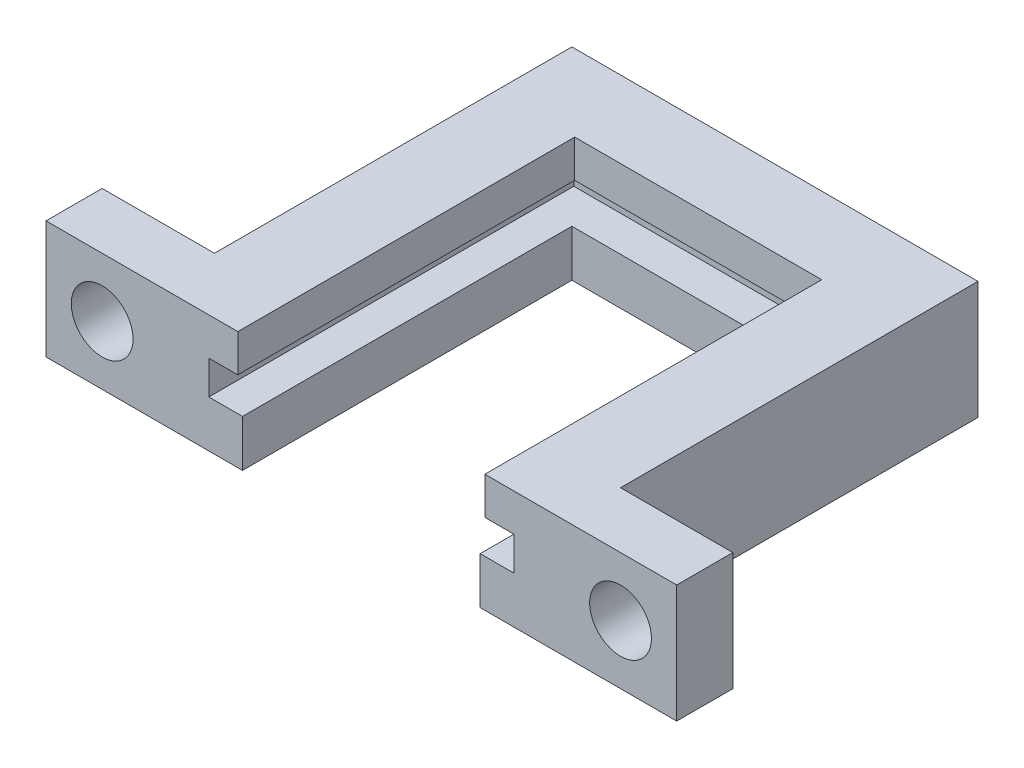
ISO-10303-21;
HEADER;
FILE_DESCRIPTION(('STEP AP214'),'2;1');
FILE_NAME('part.step','',(''),(''),'','','');
FILE_SCHEMA(('AUTOMOTIVE_DESIGN { 1 0 10303 214 1 1 1 1 }'));
ENDSEC;
DATA;
#1=APPLICATION_CONTEXT('core data for automotive mechanical design processes');
#2=APPLICATION_PROTOCOL_DEFINITION('international standard','automotive_design',2000,#1);
#3=PRODUCT_CONTEXT('',#1,'mechanical');
#4=PRODUCT('Part','Part','',(#3));
#5=PRODUCT_RELATED_PRODUCT_CATEGORY('part','',(#4));
#6=PRODUCT_DEFINITION_FORMATION('','',#4);
#7=PRODUCT_DEFINITION_CONTEXT('part definition',#1,'design');
#8=PRODUCT_DEFINITION('design','',#6,#7);
#9=PRODUCT_DEFINITION_SHAPE('','',#8);
#10=(LENGTH_UNIT() NAMED_UNIT(*) SI_UNIT(.MILLI.,.METRE.));
#11=(NAMED_UNIT(*) PLANE_ANGLE_UNIT() SI_UNIT($,.RADIAN.));
#12=(NAMED_UNIT(*) SI_UNIT($,.STERADIAN.) SOLID_ANGLE_UNIT());
#13=UNCERTAINTY_MEASURE_WITH_UNIT(LENGTH_MEASURE(1.E-05),#10,'distance_accuracy_value','');
#14=(GEOMETRIC_REPRESENTATION_CONTEXT(3) GLOBAL_UNCERTAINTY_ASSIGNED_CONTEXT((#13)) GLOBAL_UNIT_ASSIGNED_CONTEXT((#10,
#11,#12)) REPRESENTATION_CONTEXT('',''));
#15=CARTESIAN_POINT('',(0.,0.,0.));
#16=DIRECTION('',(0.,0.,1.));
#17=DIRECTION('',(1.,0.,0.));
#18=AXIS2_PLACEMENT_3D('',#15,#16,#17);
#19=CARTESIAN_POINT('',(0.,2.5,0.));
#20=DIRECTION('',(0.,-1.,0.));
#21=DIRECTION('',(0.,0.,-1.));
#22=AXIS2_PLACEMENT_3D('',#19,#20,#21);
#23=PLANE('',#22);
#24=DIRECTION('',(0.,0.,1.));
#25=VECTOR('',#24,1.);
#26=CARTESIAN_POINT('',(19.,2.5,0.));
#27=LINE('',#26,#25);
#28=CARTESIAN_POINT('',(19.,2.5,-19.5));
#29=VERTEX_POINT('',#28);
#30=CARTESIAN_POINT('',(19.,2.5,0.));
#31=VERTEX_POINT('',#30);
#32=EDGE_CURVE('E278',#29,#31,#27,.T.);
#33=ORIENTED_EDGE('',*,*,#32,.F.);
#34=DIRECTION('',(1.,0.,0.));
#35=VECTOR('',#34,1.);
#36=CARTESIAN_POINT('',(19.,2.5,-19.5));
#37=LINE('',#36,#35);
#38=CARTESIAN_POINT('',(2.7,2.5,-19.5));
#39=VERTEX_POINT('',#38);
#40=EDGE_CURVE('E287',#39,#29,#37,.T.);
#41=ORIENTED_EDGE('',*,*,#40,.F.);
#42=DIRECTION('',(0.,0.,-1.));
#43=VECTOR('',#42,1.);
#44=CARTESIAN_POINT('',(2.7,2.5,-19.5));
#45=LINE('',#44,#43);
#46=CARTESIAN_POINT('',(2.7,2.5,0.));
#47=VERTEX_POINT('',#46);
#48=EDGE_CURVE('E273',#47,#39,#45,.T.);
#49=ORIENTED_EDGE('',*,*,#48,.F.);
#50=DIRECTION('',(1.,0.,0.));
#51=VECTOR('',#50,1.);
#52=CARTESIAN_POINT('',(4.5,2.5,0.));
#53=LINE('',#52,#51);
#54=CARTESIAN_POINT('',(4.5,2.5,0.));
#55=VERTEX_POINT('',#54);
#56=EDGE_CURVE('E304',#47,#55,#53,.T.);
#57=ORIENTED_EDGE('',*,*,#56,.T.);
#58=DIRECTION('',(0.,0.,-1.));
#59=VECTOR('',#58,1.);
#60=CARTESIAN_POINT('',(4.5,2.5,-17.6));
#61=LINE('',#60,#59);
#62=CARTESIAN_POINT('',(4.5,2.5,-17.6));
#63=VERTEX_POINT('',#62);
#64=EDGE_CURVE('E306',#55,#63,#61,.T.);
#65=ORIENTED_EDGE('',*,*,#64,.T.);
#66=DIRECTION('',(1.,0.,0.));
#67=VECTOR('',#66,1.);
#68=CARTESIAN_POINT('',(17.2,2.5,-17.6));
#69=LINE('',#68,#67);
#70=CARTESIAN_POINT('',(17.2,2.5,-17.6));
#71=VERTEX_POINT('',#70);
#72=EDGE_CURVE('E309',#63,#71,#69,.T.);
#73=ORIENTED_EDGE('',*,*,#72,.T.);
#74=DIRECTION('',(0.,0.,1.));
#75=VECTOR('',#74,1.);
#76=CARTESIAN_POINT('',(17.2,2.5,0.));
#77=LINE('',#76,#75);
#78=CARTESIAN_POINT('',(17.2,2.5,0.));
#79=VERTEX_POINT('',#78);
#80=EDGE_CURVE('E311',#71,#79,#77,.T.);
#81=ORIENTED_EDGE('',*,*,#80,.T.);
#82=DIRECTION('',(1.,0.,0.));
#83=VECTOR('',#82,1.);
#84=CARTESIAN_POINT('',(21.7,2.5,0.));
#85=LINE('',#84,#83);
#86=EDGE_CURVE('E313',#79,#31,#85,.T.);
#87=ORIENTED_EDGE('',*,*,#86,.T.);
#88=EDGE_LOOP('',(#33,#41,#49,#57,#65,#73,#81,#87));
#89=FACE_BOUND('',#88,.T.);
#90=ADVANCED_FACE('F39',(#89),#23,.F.);
#91=CARTESIAN_POINT('',(4.5,2.5,0.));
#92=DIRECTION('',(0.,0.,-1.));
#93=DIRECTION('',(-1.,0.,0.));
#94=AXIS2_PLACEMENT_3D('',#91,#92,#93);
#95=PLANE('',#94);
#96=DIRECTION('',(1.,0.,0.));
#97=VECTOR('',#96,1.);
#98=CARTESIAN_POINT('',(4.5,0.,0.));
#99=LINE('',#98,#97);
#100=CARTESIAN_POINT('',(-6.,0.,0.));
#101=VERTEX_POINT('',#100);
#102=CARTESIAN_POINT('',(4.5,0.,0.));
#103=VERTEX_POINT('',#102);
#104=EDGE_CURVE('E303',#101,#103,#99,.T.);
#105=ORIENTED_EDGE('',*,*,#104,.T.);
#106=DIRECTION('',(0.,-1.,0.));
#107=VECTOR('',#106,1.);
#108=CARTESIAN_POINT('',(4.5,2.5,0.));
#109=LINE('',#108,#107);
#110=EDGE_CURVE('E11',#55,#103,#109,.T.);
#111=ORIENTED_EDGE('',*,*,#110,.F.);
#112=ORIENTED_EDGE('',*,*,#56,.F.);
#113=DIRECTION('',(0.,-1.,0.));
#114=VECTOR('',#113,1.);
#115=CARTESIAN_POINT('',(2.7,4.3,0.));
#116=LINE('',#115,#114);
#117=CARTESIAN_POINT('',(2.7,4.3,0.));
#118=VERTEX_POINT('',#117);
#119=EDGE_CURVE('E300',#118,#47,#116,.T.);
#120=ORIENTED_EDGE('',*,*,#119,.F.);
#121=DIRECTION('',(1.,0.,0.));
#122=VECTOR('',#121,1.);
#123=CARTESIAN_POINT('',(4.25,4.3,0.));
#124=LINE('',#123,#122);
#125=CARTESIAN_POINT('',(4.25,4.3,0.));
#126=VERTEX_POINT('',#125);
#127=EDGE_CURVE('E229',#118,#126,#124,.T.);
#128=ORIENTED_EDGE('',*,*,#127,.T.);
#129=DIRECTION('',(0.,-1.,0.));
#130=VECTOR('',#129,1.);
#131=CARTESIAN_POINT('',(4.25,6.3,0.));
#132=LINE('',#131,#130);
#133=CARTESIAN_POINT('',(4.25,6.3,0.));
#134=VERTEX_POINT('',#133);
#135=EDGE_CURVE('E270',#134,#126,#132,.T.);
#136=ORIENTED_EDGE('',*,*,#135,.F.);
#137=DIRECTION('',(1.,0.,0.));
#138=VECTOR('',#137,1.);
#139=CARTESIAN_POINT('',(4.25,6.3,0.));
#140=LINE('',#139,#138);
#141=CARTESIAN_POINT('',(-6.,6.3,0.));
#142=VERTEX_POINT('',#141);
#143=EDGE_CURVE('E232',#142,#134,#140,.T.);
#144=ORIENTED_EDGE('',*,*,#143,.F.);
#145=DIRECTION('',(0.,-1.,0.));
#146=VECTOR('',#145,1.);
#147=CARTESIAN_POINT('',(-6.,0.,0.));
#148=LINE('',#147,#146);
#149=EDGE_CURVE('E211',#142,#101,#148,.T.);
#150=ORIENTED_EDGE('',*,*,#149,.T.);
#151=EDGE_LOOP('',(#105,#111,#112,#120,#128,#136,#144,#150));
#152=FACE_BOUND('',#151,.T.);
#153=CARTESIAN_POINT('',(-3.,3.15,0.));
#154=DIRECTION('',(0.,0.,1.));
#155=DIRECTION('',(1.,0.,0.));
#156=AXIS2_PLACEMENT_3D('',#153,#154,#155);
#157=CIRCLE('',#156,1.65);
#158=CARTESIAN_POINT('',(-1.35,3.15,0.));
#159=VERTEX_POINT('',#158);
#160=EDGE_CURVE('E206',#159,#159,#157,.T.);
#161=ORIENTED_EDGE('',*,*,#160,.F.);
#162=EDGE_LOOP('',(#161));
#163=FACE_BOUND('',#162,.T.);
#164=ADVANCED_FACE('F41',(#152,#163),#95,.F.);
#165=CARTESIAN_POINT('',(4.5,2.5,-17.6));
#166=DIRECTION('',(-1.,0.,0.));
#167=DIRECTION('',(0.,0.,1.));
#168=AXIS2_PLACEMENT_3D('',#165,#166,#167);
#169=PLANE('',#168);
#170=DIRECTION('',(0.,0.,-1.));
#171=VECTOR('',#170,1.);
#172=CARTESIAN_POINT('',(4.5,0.,-17.6));
#173=LINE('',#172,#171);
#174=CARTESIAN_POINT('',(4.5,0.,-17.6));
#175=VERTEX_POINT('',#174);
#176=EDGE_CURVE('E318',#103,#175,#173,.T.);
#177=ORIENTED_EDGE('',*,*,#176,.T.);
#178=DIRECTION('',(0.,-1.,0.));
#179=VECTOR('',#178,1.);
#180=CARTESIAN_POINT('',(4.5,2.5,-17.6));
#181=LINE('',#180,#179);
#182=EDGE_CURVE('E47',#63,#175,#181,.T.);
#183=ORIENTED_EDGE('',*,*,#182,.F.);
#184=ORIENTED_EDGE('',*,*,#64,.F.);
#185=ORIENTED_EDGE('',*,*,#110,.T.);
#186=EDGE_LOOP('',(#177,#183,#184,#185));
#187=FACE_BOUND('',#186,.T.);
#188=ADVANCED_FACE('F390',(#187),#169,.F.);
#189=CARTESIAN_POINT('',(17.2,2.5,-17.6));
#190=DIRECTION('',(0.,0.,-1.));
#191=DIRECTION('',(-1.,0.,0.));
#192=AXIS2_PLACEMENT_3D('',#189,#190,#191);
#193=PLANE('',#192);
#194=DIRECTION('',(1.,0.,0.));
#195=VECTOR('',#194,1.);
#196=CARTESIAN_POINT('',(17.2,0.,-17.6));
#197=LINE('',#196,#195);
#198=CARTESIAN_POINT('',(17.2,0.,-17.6));
#199=VERTEX_POINT('',#198);
#200=EDGE_CURVE('E320',#175,#199,#197,.T.);
#201=ORIENTED_EDGE('',*,*,#200,.T.);
#202=DIRECTION('',(0.,-1.,0.));
#203=VECTOR('',#202,1.);
#204=CARTESIAN_POINT('',(17.2,2.5,-17.6));
#205=LINE('',#204,#203);
#206=EDGE_CURVE('E339',#71,#199,#205,.T.);
#207=ORIENTED_EDGE('',*,*,#206,.F.);
#208=ORIENTED_EDGE('',*,*,#72,.F.);
#209=ORIENTED_EDGE('',*,*,#182,.T.);
#210=EDGE_LOOP('',(#201,#207,#208,#209));
#211=FACE_BOUND('',#210,.T.);
#212=ADVANCED_FACE('F346',(#211),#193,.F.);
#213=CARTESIAN_POINT('',(17.2,2.5,0.));
#214=DIRECTION('',(1.,0.,0.));
#215=DIRECTION('',(0.,0.,-1.));
#216=AXIS2_PLACEMENT_3D('',#213,#214,#215);
#217=PLANE('',#216);
#218=DIRECTION('',(0.,0.,1.));
#219=VECTOR('',#218,1.);
#220=CARTESIAN_POINT('',(17.2,0.,0.));
#221=LINE('',#220,#219);
#222=CARTESIAN_POINT('',(17.2,0.,0.));
#223=VERTEX_POINT('',#222);
#224=EDGE_CURVE('E322',#199,#223,#221,.T.);
#225=ORIENTED_EDGE('',*,*,#224,.T.);
#226=DIRECTION('',(0.,-1.,0.));
#227=VECTOR('',#226,1.);
#228=CARTESIAN_POINT('',(17.2,2.5,0.));
#229=LINE('',#228,#227);
#230=EDGE_CURVE('E336',#79,#223,#229,.T.);
#231=ORIENTED_EDGE('',*,*,#230,.F.);
#232=ORIENTED_EDGE('',*,*,#80,.F.);
#233=ORIENTED_EDGE('',*,*,#206,.T.);
#234=EDGE_LOOP('',(#225,#231,#232,#233));
#235=FACE_BOUND('',#234,.T.);
#236=ADVANCED_FACE('F353',(#235),#217,.F.);
#237=CARTESIAN_POINT('',(21.7,2.5,0.));
#238=DIRECTION('',(0.,0.,-1.));
#239=DIRECTION('',(-1.,0.,0.));
#240=AXIS2_PLACEMENT_3D('',#237,#238,#239);
#241=PLANE('',#240);
#242=DIRECTION('',(1.,0.,0.));
#243=VECTOR('',#242,1.);
#244=CARTESIAN_POINT('',(21.7,0.,0.));
#245=LINE('',#244,#243);
#246=CARTESIAN_POINT('',(27.7,0.,0.));
#247=VERTEX_POINT('',#246);
#248=EDGE_CURVE('E324',#223,#247,#245,.T.);
#249=ORIENTED_EDGE('',*,*,#248,.T.);
#250=DIRECTION('',(0.,1.,0.));
#251=VECTOR('',#250,1.);
#252=CARTESIAN_POINT('',(27.7,0.,0.));
#253=LINE('',#252,#251);
#254=CARTESIAN_POINT('',(27.7,6.3,0.));
#255=VERTEX_POINT('',#254);
#256=EDGE_CURVE('E185',#247,#255,#253,.T.);
#257=ORIENTED_EDGE('',*,*,#256,.T.);
#258=DIRECTION('',(1.,0.,0.));
#259=VECTOR('',#258,1.);
#260=CARTESIAN_POINT('',(21.7,6.3,0.));
#261=LINE('',#260,#259);
#262=CARTESIAN_POINT('',(17.45,6.3,0.));
#263=VERTEX_POINT('',#262);
#264=EDGE_CURVE('E242',#263,#255,#261,.T.);
#265=ORIENTED_EDGE('',*,*,#264,.F.);
#266=DIRECTION('',(0.,-1.,0.));
#267=VECTOR('',#266,1.);
#268=CARTESIAN_POINT('',(17.45,6.3,0.));
#269=LINE('',#268,#267);
#270=CARTESIAN_POINT('',(17.45,4.3,0.));
#271=VERTEX_POINT('',#270);
#272=EDGE_CURVE('E252',#263,#271,#269,.T.);
#273=ORIENTED_EDGE('',*,*,#272,.T.);
#274=DIRECTION('',(1.,0.,0.));
#275=VECTOR('',#274,1.);
#276=CARTESIAN_POINT('',(21.7,4.3,0.));
#277=LINE('',#276,#275);
#278=CARTESIAN_POINT('',(19.,4.3,0.));
#279=VERTEX_POINT('',#278);
#280=EDGE_CURVE('E236',#271,#279,#277,.T.);
#281=ORIENTED_EDGE('',*,*,#280,.T.);
#282=DIRECTION('',(0.,-1.,0.));
#283=VECTOR('',#282,1.);
#284=CARTESIAN_POINT('',(19.,4.3,0.));
#285=LINE('',#284,#283);
#286=EDGE_CURVE('E284',#279,#31,#285,.T.);
#287=ORIENTED_EDGE('',*,*,#286,.T.);
#288=ORIENTED_EDGE('',*,*,#86,.F.);
#289=ORIENTED_EDGE('',*,*,#230,.T.);
#290=EDGE_LOOP('',(#249,#257,#265,#273,#281,#287,#288,#289));
#291=FACE_BOUND('',#290,.T.);
#292=CARTESIAN_POINT('',(24.7,3.15,0.));
#293=DIRECTION('',(0.,0.,1.));
#294=DIRECTION('',(1.,0.,0.));
#295=AXIS2_PLACEMENT_3D('',#292,#293,#294);
#296=CIRCLE('',#295,1.65);
#297=CARTESIAN_POINT('',(26.35,3.15,0.));
#298=VERTEX_POINT('',#297);
#299=EDGE_CURVE('E638',#298,#298,#296,.T.);
#300=ORIENTED_EDGE('',*,*,#299,.F.);
#301=EDGE_LOOP('',(#300));
#302=FACE_BOUND('',#301,.T.);
#303=ADVANCED_FACE('F357',(#291,#302),#241,.F.);
#304=CARTESIAN_POINT('',(21.7,2.5,-22.1));
#305=DIRECTION('',(-1.,0.,0.));
#306=DIRECTION('',(0.,0.,1.));
#307=AXIS2_PLACEMENT_3D('',#304,#305,#306);
#308=PLANE('',#307);
#309=DIRECTION('',(0.,0.,-1.));
#310=VECTOR('',#309,1.);
#311=CARTESIAN_POINT('',(21.7,6.3,-22.1));
#312=LINE('',#311,#310);
#313=CARTESIAN_POINT('',(21.7,6.3,-3.));
#314=VERTEX_POINT('',#313);
#315=CARTESIAN_POINT('',(21.7,6.3,-22.1));
#316=VERTEX_POINT('',#315);
#317=EDGE_CURVE('E244',#314,#316,#312,.T.);
#318=ORIENTED_EDGE('',*,*,#317,.F.);
#319=DIRECTION('',(0.,-1.,0.));
#320=VECTOR('',#319,1.);
#321=CARTESIAN_POINT('',(21.7,0.,-3.));
#322=LINE('',#321,#320);
#323=CARTESIAN_POINT('',(21.7,0.,-3.));
#324=VERTEX_POINT('',#323);
#325=EDGE_CURVE('E198',#314,#324,#322,.T.);
#326=ORIENTED_EDGE('',*,*,#325,.T.);
#327=DIRECTION('',(0.,0.,-1.));
#328=VECTOR('',#327,1.);
#329=CARTESIAN_POINT('',(21.7,0.,-22.1));
#330=LINE('',#329,#328);
#331=CARTESIAN_POINT('',(21.7,0.,-22.1));
#332=VERTEX_POINT('',#331);
#333=EDGE_CURVE('E197',#324,#332,#330,.T.);
#334=ORIENTED_EDGE('',*,*,#333,.T.);
#335=DIRECTION('',(0.,-1.,0.));
#336=VECTOR('',#335,1.);
#337=CARTESIAN_POINT('',(21.7,2.5,-22.1));
#338=LINE('',#337,#336);
#339=EDGE_CURVE('E333',#316,#332,#338,.T.);
#340=ORIENTED_EDGE('',*,*,#339,.F.);
#341=EDGE_LOOP('',(#318,#326,#334,#340));
#342=FACE_BOUND('',#341,.T.);
#343=ADVANCED_FACE('F414',(#342),#308,.F.);
#344=CARTESIAN_POINT('',(0.,2.5,-22.1));
#345=DIRECTION('',(0.,0.,1.));
#346=DIRECTION('',(1.,0.,0.));
#347=AXIS2_PLACEMENT_3D('',#344,#345,#346);
#348=PLANE('',#347);
#349=DIRECTION('',(-1.,0.,0.));
#350=VECTOR('',#349,1.);
#351=CARTESIAN_POINT('',(0.,0.,-22.1));
#352=LINE('',#351,#350);
#353=CARTESIAN_POINT('',(0.,0.,-22.1));
#354=VERTEX_POINT('',#353);
#355=EDGE_CURVE('E327',#332,#354,#352,.T.);
#356=ORIENTED_EDGE('',*,*,#355,.T.);
#357=DIRECTION('',(0.,-1.,0.));
#358=VECTOR('',#357,1.);
#359=CARTESIAN_POINT('',(0.,2.5,-22.1));
#360=LINE('',#359,#358);
#361=CARTESIAN_POINT('',(0.,6.3,-22.1));
#362=VERTEX_POINT('',#361);
#363=EDGE_CURVE('E315',#362,#354,#360,.T.);
#364=ORIENTED_EDGE('',*,*,#363,.F.);
#365=DIRECTION('',(-1.,0.,0.));
#366=VECTOR('',#365,1.);
#367=CARTESIAN_POINT('',(0.,6.3,-22.1));
#368=LINE('',#367,#366);
#369=EDGE_CURVE('E246',#316,#362,#368,.T.);
#370=ORIENTED_EDGE('',*,*,#369,.F.);
#371=ORIENTED_EDGE('',*,*,#339,.T.);
#372=EDGE_LOOP('',(#356,#364,#370,#371));
#373=FACE_BOUND('',#372,.T.);
#374=ADVANCED_FACE('F411',(#373),#348,.F.);
#375=CARTESIAN_POINT('',(0.,2.5,0.));
#376=DIRECTION('',(1.,0.,0.));
#377=DIRECTION('',(0.,0.,-1.));
#378=AXIS2_PLACEMENT_3D('',#375,#376,#377);
#379=PLANE('',#378);
#380=DIRECTION('',(0.,0.,1.));
#381=VECTOR('',#380,1.);
#382=CARTESIAN_POINT('',(0.,0.,0.));
#383=LINE('',#382,#381);
#384=CARTESIAN_POINT('',(0.,0.,-3.));
#385=VERTEX_POINT('',#384);
#386=EDGE_CURVE('E307',#354,#385,#383,.T.);
#387=ORIENTED_EDGE('',*,*,#386,.T.);
#388=DIRECTION('',(0.,1.,0.));
#389=VECTOR('',#388,1.);
#390=CARTESIAN_POINT('',(0.,0.,-3.));
#391=LINE('',#390,#389);
#392=CARTESIAN_POINT('',(0.,6.3,-3.));
#393=VERTEX_POINT('',#392);
#394=EDGE_CURVE('E214',#385,#393,#391,.T.);
#395=ORIENTED_EDGE('',*,*,#394,.T.);
#396=DIRECTION('',(0.,0.,1.));
#397=VECTOR('',#396,1.);
#398=CARTESIAN_POINT('',(0.,6.3,0.));
#399=LINE('',#398,#397);
#400=EDGE_CURVE('E249',#362,#393,#399,.T.);
#401=ORIENTED_EDGE('',*,*,#400,.F.);
#402=ORIENTED_EDGE('',*,*,#363,.T.);
#403=EDGE_LOOP('',(#387,#395,#401,#402));
#404=FACE_BOUND('',#403,.T.);
#405=ADVANCED_FACE('F408',(#404),#379,.F.);
#406=CARTESIAN_POINT('',(0.,0.,0.));
#407=DIRECTION('',(0.,-1.,0.));
#408=DIRECTION('',(0.,0.,-1.));
#409=AXIS2_PLACEMENT_3D('',#406,#407,#408);
#410=PLANE('',#409);
#411=ORIENTED_EDGE('',*,*,#104,.F.);
#412=DIRECTION('',(0.,0.,1.));
#413=VECTOR('',#412,1.);
#414=CARTESIAN_POINT('',(-6.,0.,-3.));
#415=LINE('',#414,#413);
#416=CARTESIAN_POINT('',(-6.,0.,-3.));
#417=VERTEX_POINT('',#416);
#418=EDGE_CURVE('E226',#417,#101,#415,.T.);
#419=ORIENTED_EDGE('',*,*,#418,.F.);
#420=DIRECTION('',(1.,0.,0.));
#421=VECTOR('',#420,1.);
#422=CARTESIAN_POINT('',(0.,0.,-3.));
#423=LINE('',#422,#421);
#424=EDGE_CURVE('E220',#417,#385,#423,.T.);
#425=ORIENTED_EDGE('',*,*,#424,.T.);
#426=ORIENTED_EDGE('',*,*,#386,.F.);
#427=ORIENTED_EDGE('',*,*,#355,.F.);
#428=ORIENTED_EDGE('',*,*,#333,.F.);
#429=DIRECTION('',(1.,0.,0.));
#430=VECTOR('',#429,1.);
#431=CARTESIAN_POINT('',(21.7,0.,-3.));
#432=LINE('',#431,#430);
#433=CARTESIAN_POINT('',(27.7,0.,-3.));
#434=VERTEX_POINT('',#433);
#435=EDGE_CURVE('E54',#324,#434,#432,.T.);
#436=ORIENTED_EDGE('',*,*,#435,.T.);
#437=DIRECTION('',(0.,0.,1.));
#438=VECTOR('',#437,1.);
#439=CARTESIAN_POINT('',(27.7,0.,-3.));
#440=LINE('',#439,#438);
#441=EDGE_CURVE('E179',#434,#247,#440,.T.);
#442=ORIENTED_EDGE('',*,*,#441,.T.);
#443=ORIENTED_EDGE('',*,*,#248,.F.);
#444=ORIENTED_EDGE('',*,*,#224,.F.);
#445=ORIENTED_EDGE('',*,*,#200,.F.);
#446=ORIENTED_EDGE('',*,*,#176,.F.);
#447=EDGE_LOOP('',(#411,#419,#425,#426,#427,#428,#436,#442,#443,#444,#445,#446));
#448=FACE_BOUND('',#447,.T.);
#449=ADVANCED_FACE('F195',(#448),#410,.T.);
#450=CARTESIAN_POINT('',(2.7,4.3,-19.5));
#451=DIRECTION('',(-1.,0.,0.));
#452=DIRECTION('',(0.,0.,1.));
#453=AXIS2_PLACEMENT_3D('',#450,#451,#452);
#454=PLANE('',#453);
#455=ORIENTED_EDGE('',*,*,#48,.T.);
#456=DIRECTION('',(0.,-1.,0.));
#457=VECTOR('',#456,1.);
#458=CARTESIAN_POINT('',(2.7,4.3,-19.5));
#459=LINE('',#458,#457);
#460=CARTESIAN_POINT('',(2.7,4.3,-19.5));
#461=VERTEX_POINT('',#460);
#462=EDGE_CURVE('E297',#461,#39,#459,.T.);
#463=ORIENTED_EDGE('',*,*,#462,.F.);
#464=DIRECTION('',(0.,0.,-1.));
#465=VECTOR('',#464,1.);
#466=CARTESIAN_POINT('',(2.7,4.3,-19.5));
#467=LINE('',#466,#465);
#468=EDGE_CURVE('E274',#118,#461,#467,.T.);
#469=ORIENTED_EDGE('',*,*,#468,.F.);
#470=ORIENTED_EDGE('',*,*,#119,.T.);
#471=EDGE_LOOP('',(#455,#463,#469,#470));
#472=FACE_BOUND('',#471,.T.);
#473=ADVANCED_FACE('F368',(#472),#454,.F.);
#474=CARTESIAN_POINT('',(19.,4.3,-19.5));
#475=DIRECTION('',(0.,0.,-1.));
#476=DIRECTION('',(-1.,0.,0.));
#477=AXIS2_PLACEMENT_3D('',#474,#475,#476);
#478=PLANE('',#477);
#479=ORIENTED_EDGE('',*,*,#40,.T.);
#480=DIRECTION('',(0.,-1.,0.));
#481=VECTOR('',#480,1.);
#482=CARTESIAN_POINT('',(19.,4.3,-19.5));
#483=LINE('',#482,#481);
#484=CARTESIAN_POINT('',(19.,4.3,-19.5));
#485=VERTEX_POINT('',#484);
#486=EDGE_CURVE('E294',#485,#29,#483,.T.);
#487=ORIENTED_EDGE('',*,*,#486,.F.);
#488=DIRECTION('',(1.,0.,0.));
#489=VECTOR('',#488,1.);
#490=CARTESIAN_POINT('',(19.,4.3,-19.5));
#491=LINE('',#490,#489);
#492=EDGE_CURVE('E277',#461,#485,#491,.T.);
#493=ORIENTED_EDGE('',*,*,#492,.F.);
#494=ORIENTED_EDGE('',*,*,#462,.T.);
#495=EDGE_LOOP('',(#479,#487,#493,#494));
#496=FACE_BOUND('',#495,.T.);
#497=ADVANCED_FACE('F365',(#496),#478,.F.);
#498=CARTESIAN_POINT('',(19.,4.3,0.));
#499=DIRECTION('',(1.,0.,0.));
#500=DIRECTION('',(0.,0.,-1.));
#501=AXIS2_PLACEMENT_3D('',#498,#499,#500);
#502=PLANE('',#501);
#503=ORIENTED_EDGE('',*,*,#32,.T.);
#504=ORIENTED_EDGE('',*,*,#286,.F.);
#505=DIRECTION('',(0.,0.,1.));
#506=VECTOR('',#505,1.);
#507=CARTESIAN_POINT('',(19.,4.3,0.));
#508=LINE('',#507,#506);
#509=EDGE_CURVE('E281',#485,#279,#508,.T.);
#510=ORIENTED_EDGE('',*,*,#509,.F.);
#511=ORIENTED_EDGE('',*,*,#486,.T.);
#512=EDGE_LOOP('',(#503,#504,#510,#511));
#513=FACE_BOUND('',#512,.T.);
#514=ADVANCED_FACE('F361',(#513),#502,.F.);
#515=CARTESIAN_POINT('',(4.25,6.3,-18.));
#516=DIRECTION('',(-1.,0.,0.));
#517=DIRECTION('',(0.,0.,1.));
#518=AXIS2_PLACEMENT_3D('',#515,#516,#517);
#519=PLANE('',#518);
#520=DIRECTION('',(0.,0.,-1.));
#521=VECTOR('',#520,1.);
#522=CARTESIAN_POINT('',(4.25,4.3,-18.));
#523=LINE('',#522,#521);
#524=CARTESIAN_POINT('',(4.25,4.3,-18.));
#525=VERTEX_POINT('',#524);
#526=EDGE_CURVE('E254',#126,#525,#523,.T.);
#527=ORIENTED_EDGE('',*,*,#526,.T.);
#528=DIRECTION('',(0.,-1.,0.));
#529=VECTOR('',#528,1.);
#530=CARTESIAN_POINT('',(4.25,6.3,-18.));
#531=LINE('',#530,#529);
#532=CARTESIAN_POINT('',(4.25,6.3,-18.));
#533=VERTEX_POINT('',#532);
#534=EDGE_CURVE('E267',#533,#525,#531,.T.);
#535=ORIENTED_EDGE('',*,*,#534,.F.);
#536=DIRECTION('',(0.,0.,-1.));
#537=VECTOR('',#536,1.);
#538=CARTESIAN_POINT('',(4.25,6.3,-18.));
#539=LINE('',#538,#537);
#540=EDGE_CURVE('E235',#134,#533,#539,.T.);
#541=ORIENTED_EDGE('',*,*,#540,.F.);
#542=ORIENTED_EDGE('',*,*,#135,.T.);
#543=EDGE_LOOP('',(#527,#535,#541,#542));
#544=FACE_BOUND('',#543,.T.);
#545=ADVANCED_FACE('F382',(#544),#519,.F.);
#546=CARTESIAN_POINT('',(17.45,6.3,-18.));
#547=DIRECTION('',(0.,0.,-1.));
#548=DIRECTION('',(-1.,0.,0.));
#549=AXIS2_PLACEMENT_3D('',#546,#547,#548);
#550=PLANE('',#549);
#551=DIRECTION('',(1.,0.,0.));
#552=VECTOR('',#551,1.);
#553=CARTESIAN_POINT('',(17.45,4.3,-18.));
#554=LINE('',#553,#552);
#555=CARTESIAN_POINT('',(17.45,4.3,-18.));
#556=VERTEX_POINT('',#555);
#557=EDGE_CURVE('E256',#525,#556,#554,.T.);
#558=ORIENTED_EDGE('',*,*,#557,.T.);
#559=DIRECTION('',(0.,-1.,0.));
#560=VECTOR('',#559,1.);
#561=CARTESIAN_POINT('',(17.45,6.3,-18.));
#562=LINE('',#561,#560);
#563=CARTESIAN_POINT('',(17.45,6.3,-18.));
#564=VERTEX_POINT('',#563);
#565=EDGE_CURVE('E264',#564,#556,#562,.T.);
#566=ORIENTED_EDGE('',*,*,#565,.F.);
#567=DIRECTION('',(1.,0.,0.));
#568=VECTOR('',#567,1.);
#569=CARTESIAN_POINT('',(17.45,6.3,-18.));
#570=LINE('',#569,#568);
#571=EDGE_CURVE('E238',#533,#564,#570,.T.);
#572=ORIENTED_EDGE('',*,*,#571,.F.);
#573=ORIENTED_EDGE('',*,*,#534,.T.);
#574=EDGE_LOOP('',(#558,#566,#572,#573));
#575=FACE_BOUND('',#574,.T.);
#576=ADVANCED_FACE('F520',(#575),#550,.F.);
#577=CARTESIAN_POINT('',(17.45,6.3,0.));
#578=DIRECTION('',(1.,0.,0.));
#579=DIRECTION('',(0.,0.,-1.));
#580=AXIS2_PLACEMENT_3D('',#577,#578,#579);
#581=PLANE('',#580);
#582=DIRECTION('',(0.,0.,1.));
#583=VECTOR('',#582,1.);
#584=CARTESIAN_POINT('',(17.45,4.3,0.));
#585=LINE('',#584,#583);
#586=EDGE_CURVE('E258',#556,#271,#585,.T.);
#587=ORIENTED_EDGE('',*,*,#586,.T.);
#588=ORIENTED_EDGE('',*,*,#272,.F.);
#589=DIRECTION('',(0.,0.,1.));
#590=VECTOR('',#589,1.);
#591=CARTESIAN_POINT('',(17.45,6.3,0.));
#592=LINE('',#591,#590);
#593=EDGE_CURVE('E240',#564,#263,#592,.T.);
#594=ORIENTED_EDGE('',*,*,#593,.F.);
#595=ORIENTED_EDGE('',*,*,#565,.T.);
#596=EDGE_LOOP('',(#587,#588,#594,#595));
#597=FACE_BOUND('',#596,.T.);
#598=ADVANCED_FACE('F527',(#597),#581,.F.);
#599=CARTESIAN_POINT('',(0.,6.3,0.));
#600=DIRECTION('',(0.,-1.,0.));
#601=DIRECTION('',(0.,0.,-1.));
#602=AXIS2_PLACEMENT_3D('',#599,#600,#601);
#603=PLANE('',#602);
#604=ORIENTED_EDGE('',*,*,#143,.T.);
#605=ORIENTED_EDGE('',*,*,#540,.T.);
#606=ORIENTED_EDGE('',*,*,#571,.T.);
#607=ORIENTED_EDGE('',*,*,#593,.T.);
#608=ORIENTED_EDGE('',*,*,#264,.T.);
#609=DIRECTION('',(0.,0.,1.));
#610=VECTOR('',#609,1.);
#611=CARTESIAN_POINT('',(27.7,6.3,-3.));
#612=LINE('',#611,#610);
#613=CARTESIAN_POINT('',(27.7,6.3,-3.));
#614=VERTEX_POINT('',#613);
#615=EDGE_CURVE('E188',#614,#255,#612,.T.);
#616=ORIENTED_EDGE('',*,*,#615,.F.);
#617=DIRECTION('',(-1.,0.,0.));
#618=VECTOR('',#617,1.);
#619=CARTESIAN_POINT('',(21.7,6.3,-3.));
#620=LINE('',#619,#618);
#621=EDGE_CURVE('E189',#614,#314,#620,.T.);
#622=ORIENTED_EDGE('',*,*,#621,.T.);
#623=ORIENTED_EDGE('',*,*,#317,.T.);
#624=ORIENTED_EDGE('',*,*,#369,.T.);
#625=ORIENTED_EDGE('',*,*,#400,.T.);
#626=DIRECTION('',(-1.,0.,0.));
#627=VECTOR('',#626,1.);
#628=CARTESIAN_POINT('',(0.,6.3,-3.));
#629=LINE('',#628,#627);
#630=CARTESIAN_POINT('',(-6.,6.3,-3.));
#631=VERTEX_POINT('',#630);
#632=EDGE_CURVE('E62',#393,#631,#629,.T.);
#633=ORIENTED_EDGE('',*,*,#632,.T.);
#634=DIRECTION('',(0.,0.,1.));
#635=VECTOR('',#634,1.);
#636=CARTESIAN_POINT('',(-6.,6.3,-3.));
#637=LINE('',#636,#635);
#638=EDGE_CURVE('E223',#631,#142,#637,.T.);
#639=ORIENTED_EDGE('',*,*,#638,.T.);
#640=EDGE_LOOP('',(#604,#605,#606,#607,#608,#616,#622,#623,#624,#625,#633,#639));
#641=FACE_BOUND('',#640,.T.);
#642=ADVANCED_FACE('F385',(#641),#603,.F.);
#643=CARTESIAN_POINT('',(0.,4.3,0.));
#644=DIRECTION('',(0.,-1.,0.));
#645=DIRECTION('',(0.,0.,-1.));
#646=AXIS2_PLACEMENT_3D('',#643,#644,#645);
#647=PLANE('',#646);
#648=ORIENTED_EDGE('',*,*,#127,.F.);
#649=ORIENTED_EDGE('',*,*,#468,.T.);
#650=ORIENTED_EDGE('',*,*,#492,.T.);
#651=ORIENTED_EDGE('',*,*,#509,.T.);
#652=ORIENTED_EDGE('',*,*,#280,.F.);
#653=ORIENTED_EDGE('',*,*,#586,.F.);
#654=ORIENTED_EDGE('',*,*,#557,.F.);
#655=ORIENTED_EDGE('',*,*,#526,.F.);
#656=EDGE_LOOP('',(#648,#649,#650,#651,#652,#653,#654,#655));
#657=FACE_BOUND('',#656,.T.);
#658=ADVANCED_FACE('F377',(#657),#647,.T.);
#659=CARTESIAN_POINT('',(-6.,0.,-3.));
#660=DIRECTION('',(-1.,0.,0.));
#661=DIRECTION('',(0.,0.,1.));
#662=AXIS2_PLACEMENT_3D('',#659,#660,#661);
#663=PLANE('',#662);
#664=ORIENTED_EDGE('',*,*,#149,.F.);
#665=ORIENTED_EDGE('',*,*,#638,.F.);
#666=DIRECTION('',(0.,-1.,0.));
#667=VECTOR('',#666,1.);
#668=CARTESIAN_POINT('',(-6.,0.,-3.));
#669=LINE('',#668,#667);
#670=EDGE_CURVE('E217',#631,#417,#669,.T.);
#671=ORIENTED_EDGE('',*,*,#670,.T.);
#672=ORIENTED_EDGE('',*,*,#418,.T.);
#673=EDGE_LOOP('',(#664,#665,#671,#672));
#674=FACE_BOUND('',#673,.T.);
#675=ADVANCED_FACE('F387',(#674),#663,.T.);
#676=CARTESIAN_POINT('',(0.,0.,-3.));
#677=DIRECTION('',(0.,0.,1.));
#678=DIRECTION('',(1.,0.,0.));
#679=AXIS2_PLACEMENT_3D('',#676,#677,#678);
#680=PLANE('',#679);
#681=CARTESIAN_POINT('',(-3.,3.15,-3.));
#682=DIRECTION('',(0.,0.,1.));
#683=DIRECTION('',(1.,0.,0.));
#684=AXIS2_PLACEMENT_3D('',#681,#682,#683);
#685=CIRCLE('',#684,1.65);
#686=CARTESIAN_POINT('',(-1.35,3.15,-3.));
#687=VERTEX_POINT('',#686);
#688=EDGE_CURVE('E208',#687,#687,#685,.T.);
#689=ORIENTED_EDGE('',*,*,#688,.T.);
#690=EDGE_LOOP('',(#689));
#691=FACE_BOUND('',#690,.T.);
#692=ORIENTED_EDGE('',*,*,#394,.F.);
#693=ORIENTED_EDGE('',*,*,#424,.F.);
#694=ORIENTED_EDGE('',*,*,#670,.F.);
#695=ORIENTED_EDGE('',*,*,#632,.F.);
#696=EDGE_LOOP('',(#692,#693,#694,#695));
#697=FACE_BOUND('',#696,.T.);
#698=ADVANCED_FACE('F572',(#691,#697),#680,.F.);
#699=CARTESIAN_POINT('',(-3.,3.15,-3.));
#700=DIRECTION('',(0.,0.,1.));
#701=DIRECTION('',(1.,0.,0.));
#702=AXIS2_PLACEMENT_3D('',#699,#700,#701);
#703=CYLINDRICAL_SURFACE('',#702,1.65);
#704=ORIENTED_EDGE('',*,*,#688,.F.);
#705=EDGE_LOOP('',(#704));
#706=FACE_BOUND('',#705,.T.);
#707=ORIENTED_EDGE('',*,*,#160,.T.);
#708=EDGE_LOOP('',(#707));
#709=FACE_BOUND('',#708,.T.);
#710=ADVANCED_FACE('F580',(#706,#709),#703,.F.);
#711=CARTESIAN_POINT('',(27.7,0.,-3.));
#712=DIRECTION('',(1.,0.,0.));
#713=DIRECTION('',(0.,0.,-1.));
#714=AXIS2_PLACEMENT_3D('',#711,#712,#713);
#715=PLANE('',#714);
#716=ORIENTED_EDGE('',*,*,#256,.F.);
#717=ORIENTED_EDGE('',*,*,#441,.F.);
#718=DIRECTION('',(0.,1.,0.));
#719=VECTOR('',#718,1.);
#720=CARTESIAN_POINT('',(27.7,0.,-3.));
#721=LINE('',#720,#719);
#722=EDGE_CURVE('E182',#434,#614,#721,.T.);
#723=ORIENTED_EDGE('',*,*,#722,.T.);
#724=ORIENTED_EDGE('',*,*,#615,.T.);
#725=EDGE_LOOP('',(#716,#717,#723,#724));
#726=FACE_BOUND('',#725,.T.);
#727=ADVANCED_FACE('F180',(#726),#715,.T.);
#728=CARTESIAN_POINT('',(0.,0.,-3.));
#729=DIRECTION('',(0.,0.,-1.));
#730=DIRECTION('',(-1.,0.,0.));
#731=AXIS2_PLACEMENT_3D('',#728,#729,#730);
#732=PLANE('',#731);
#733=CARTESIAN_POINT('',(24.7,3.15,-3.));
#734=DIRECTION('',(0.,0.,1.));
#735=DIRECTION('',(1.,0.,0.));
#736=AXIS2_PLACEMENT_3D('',#733,#734,#735);
#737=CIRCLE('',#736,1.65);
#738=CARTESIAN_POINT('',(26.35,3.15,-3.));
#739=VERTEX_POINT('',#738);
#740=EDGE_CURVE('E205',#739,#739,#737,.T.);
#741=ORIENTED_EDGE('',*,*,#740,.T.);
#742=EDGE_LOOP('',(#741));
#743=FACE_BOUND('',#742,.T.);
#744=ORIENTED_EDGE('',*,*,#325,.F.);
#745=ORIENTED_EDGE('',*,*,#621,.F.);
#746=ORIENTED_EDGE('',*,*,#722,.F.);
#747=ORIENTED_EDGE('',*,*,#435,.F.);
#748=EDGE_LOOP('',(#744,#745,#746,#747));
#749=FACE_BOUND('',#748,.T.);
#750=ADVANCED_FACE('F191',(#743,#749),#732,.T.);
#751=CARTESIAN_POINT('',(24.7,3.15,-3.));
#752=DIRECTION('',(0.,0.,1.));
#753=DIRECTION('',(1.,0.,0.));
#754=AXIS2_PLACEMENT_3D('',#751,#752,#753);
#755=CYLINDRICAL_SURFACE('',#754,1.65);
#756=ORIENTED_EDGE('',*,*,#740,.F.);
#757=EDGE_LOOP('',(#756));
#758=FACE_BOUND('',#757,.T.);
#759=ORIENTED_EDGE('',*,*,#299,.T.);
#760=EDGE_LOOP('',(#759));
#761=FACE_BOUND('',#760,.T.);
#762=ADVANCED_FACE('F604',(#758,#761),#755,.F.);
#763=CLOSED_SHELL('',(#90,#164,#188,#212,#236,#303,#343,#374,#405,#449,#473,#497,#514,#545,#576,
#598,#642,#658,#675,#698,#710,#727,#750,#762));
#764=MANIFOLD_SOLID_BREP('B2',#763);
#765=ADVANCED_BREP_SHAPE_REPRESENTATION('',(#18,#764),#14);
#766=SHAPE_DEFINITION_REPRESENTATION(#9,#765);
ENDSEC;
END-ISO-10303-21;
